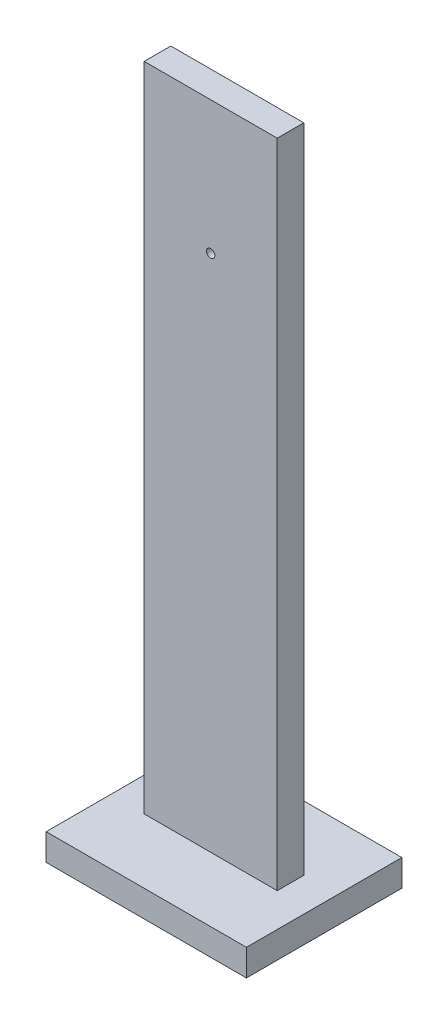
ISO-10303-21;
HEADER;
FILE_DESCRIPTION(('STEP AP214'),'2;1');
FILE_NAME('part.step','',(''),(''),'','','');
FILE_SCHEMA(('AUTOMOTIVE_DESIGN { 1 0 10303 214 1 1 1 1 }'));
ENDSEC;
DATA;
#1=APPLICATION_CONTEXT('core data for automotive mechanical design processes');
#2=APPLICATION_PROTOCOL_DEFINITION('international standard','automotive_design',2000,#1);
#3=PRODUCT_CONTEXT('',#1,'mechanical');
#4=PRODUCT('Part','Part','',(#3));
#5=PRODUCT_RELATED_PRODUCT_CATEGORY('part','',(#4));
#6=PRODUCT_DEFINITION_FORMATION('','',#4);
#7=PRODUCT_DEFINITION_CONTEXT('part definition',#1,'design');
#8=PRODUCT_DEFINITION('design','',#6,#7);
#9=PRODUCT_DEFINITION_SHAPE('','',#8);
#10=(LENGTH_UNIT() NAMED_UNIT(*) SI_UNIT(.MILLI.,.METRE.));
#11=(NAMED_UNIT(*) PLANE_ANGLE_UNIT() SI_UNIT($,.RADIAN.));
#12=(NAMED_UNIT(*) SI_UNIT($,.STERADIAN.) SOLID_ANGLE_UNIT());
#13=UNCERTAINTY_MEASURE_WITH_UNIT(LENGTH_MEASURE(1.E-05),#10,'distance_accuracy_value','');
#14=(GEOMETRIC_REPRESENTATION_CONTEXT(3) GLOBAL_UNCERTAINTY_ASSIGNED_CONTEXT((#13)) GLOBAL_UNIT_ASSIGNED_CONTEXT((#10,
#11,#12)) REPRESENTATION_CONTEXT('',''));
#15=CARTESIAN_POINT('',(0.,0.,0.));
#16=DIRECTION('',(0.,0.,1.));
#17=DIRECTION('',(1.,0.,0.));
#18=AXIS2_PLACEMENT_3D('',#15,#16,#17);
#19=CARTESIAN_POINT('',(0.,0.,10.));
#20=DIRECTION('',(0.,0.,-1.));
#21=DIRECTION('',(-1.,0.,0.));
#22=AXIS2_PLACEMENT_3D('',#19,#20,#21);
#23=PLANE('',#22);
#24=DIRECTION('',(0.,-1.,0.));
#25=VECTOR('',#24,1.);
#26=CARTESIAN_POINT('',(-50.,-250.,10.));
#27=LINE('',#26,#25);
#28=CARTESIAN_POINT('',(-50.,250.,10.));
#29=VERTEX_POINT('',#28);
#30=CARTESIAN_POINT('',(-50.,-240.,10.));
#31=VERTEX_POINT('',#30);
#32=EDGE_CURVE('E99',#29,#31,#27,.T.);
#33=ORIENTED_EDGE('',*,*,#32,.T.);
#34=DIRECTION('',(1.,0.,0.));
#35=VECTOR('',#34,1.);
#36=CARTESIAN_POINT('',(0.,-240.,10.));
#37=LINE('',#36,#35);
#38=CARTESIAN_POINT('',(50.,-240.,10.));
#39=VERTEX_POINT('',#38);
#40=EDGE_CURVE('E61',#31,#39,#37,.T.);
#41=ORIENTED_EDGE('',*,*,#40,.T.);
#42=DIRECTION('',(0.,1.,0.));
#43=VECTOR('',#42,1.);
#44=CARTESIAN_POINT('',(50.,-250.,10.));
#45=LINE('',#44,#43);
#46=CARTESIAN_POINT('',(50.,250.,10.));
#47=VERTEX_POINT('',#46);
#48=EDGE_CURVE('E108',#39,#47,#45,.T.);
#49=ORIENTED_EDGE('',*,*,#48,.T.);
#50=DIRECTION('',(-1.,0.,0.));
#51=VECTOR('',#50,1.);
#52=CARTESIAN_POINT('',(-50.,250.,10.));
#53=LINE('',#52,#51);
#54=EDGE_CURVE('E69',#47,#29,#53,.T.);
#55=ORIENTED_EDGE('',*,*,#54,.T.);
#56=EDGE_LOOP('',(#33,#41,#49,#55));
#57=FACE_BOUND('',#56,.T.);
#58=CARTESIAN_POINT('',(0.,150.,10.));
#59=DIRECTION('',(0.,0.,1.));
#60=DIRECTION('',(1.,0.,0.));
#61=AXIS2_PLACEMENT_3D('',#58,#59,#60);
#62=CIRCLE('',#61,3.125);
#63=CARTESIAN_POINT('',(3.125,150.,10.));
#64=VERTEX_POINT('',#63);
#65=EDGE_CURVE('E120',#64,#64,#62,.T.);
#66=ORIENTED_EDGE('',*,*,#65,.F.);
#67=EDGE_LOOP('',(#66));
#68=FACE_BOUND('',#67,.T.);
#69=ADVANCED_FACE('F45',(#57,#68),#23,.F.);
#70=CARTESIAN_POINT('',(0.,0.,-10.));
#71=DIRECTION('',(0.,0.,-1.));
#72=DIRECTION('',(-1.,0.,0.));
#73=AXIS2_PLACEMENT_3D('',#70,#71,#72);
#74=PLANE('',#73);
#75=DIRECTION('',(1.,0.,0.));
#76=VECTOR('',#75,1.);
#77=CARTESIAN_POINT('',(0.,-240.,-10.));
#78=LINE('',#77,#76);
#79=CARTESIAN_POINT('',(-50.,-240.,-10.));
#80=VERTEX_POINT('',#79);
#81=CARTESIAN_POINT('',(50.,-240.,-10.));
#82=VERTEX_POINT('',#81);
#83=EDGE_CURVE('E106',#80,#82,#78,.T.);
#84=ORIENTED_EDGE('',*,*,#83,.F.);
#85=DIRECTION('',(0.,-1.,0.));
#86=VECTOR('',#85,1.);
#87=CARTESIAN_POINT('',(-50.,-250.,-10.));
#88=LINE('',#87,#86);
#89=CARTESIAN_POINT('',(-50.,250.,-10.));
#90=VERTEX_POINT('',#89);
#91=EDGE_CURVE('E92',#90,#80,#88,.T.);
#92=ORIENTED_EDGE('',*,*,#91,.F.);
#93=DIRECTION('',(-1.,0.,0.));
#94=VECTOR('',#93,1.);
#95=CARTESIAN_POINT('',(-50.,250.,-10.));
#96=LINE('',#95,#94);
#97=CARTESIAN_POINT('',(50.,250.,-10.));
#98=VERTEX_POINT('',#97);
#99=EDGE_CURVE('E82',#98,#90,#96,.T.);
#100=ORIENTED_EDGE('',*,*,#99,.F.);
#101=DIRECTION('',(0.,1.,0.));
#102=VECTOR('',#101,1.);
#103=CARTESIAN_POINT('',(50.,-250.,-10.));
#104=LINE('',#103,#102);
#105=EDGE_CURVE('E93',#82,#98,#104,.T.);
#106=ORIENTED_EDGE('',*,*,#105,.F.);
#107=EDGE_LOOP('',(#84,#92,#100,#106));
#108=FACE_BOUND('',#107,.T.);
#109=CARTESIAN_POINT('',(0.,150.,-10.));
#110=DIRECTION('',(0.,0.,1.));
#111=DIRECTION('',(1.,0.,0.));
#112=AXIS2_PLACEMENT_3D('',#109,#110,#111);
#113=CIRCLE('',#112,3.125);
#114=CARTESIAN_POINT('',(3.125,150.,-10.));
#115=VERTEX_POINT('',#114);
#116=EDGE_CURVE('E125',#115,#115,#113,.T.);
#117=ORIENTED_EDGE('',*,*,#116,.T.);
#118=EDGE_LOOP('',(#117));
#119=FACE_BOUND('',#118,.T.);
#120=ADVANCED_FACE('F103',(#108,#119),#74,.T.);
#121=CARTESIAN_POINT('',(50.,-250.,10.));
#122=DIRECTION('',(-1.,0.,0.));
#123=DIRECTION('',(0.,0.,1.));
#124=AXIS2_PLACEMENT_3D('',#121,#122,#123);
#125=PLANE('',#124);
#126=ORIENTED_EDGE('',*,*,#48,.F.);
#127=DIRECTION('',(0.,0.,-1.));
#128=VECTOR('',#127,1.);
#129=CARTESIAN_POINT('',(50.,-240.,10.));
#130=LINE('',#129,#128);
#131=EDGE_CURVE('E131',#39,#82,#130,.T.);
#132=ORIENTED_EDGE('',*,*,#131,.T.);
#133=ORIENTED_EDGE('',*,*,#105,.T.);
#134=DIRECTION('',(0.,0.,-1.));
#135=VECTOR('',#134,1.);
#136=CARTESIAN_POINT('',(50.,250.,10.));
#137=LINE('',#136,#135);
#138=EDGE_CURVE('E54',#47,#98,#137,.T.);
#139=ORIENTED_EDGE('',*,*,#138,.F.);
#140=EDGE_LOOP('',(#126,#132,#133,#139));
#141=FACE_BOUND('',#140,.T.);
#142=ADVANCED_FACE('F47',(#141),#125,.F.);
#143=CARTESIAN_POINT('',(-50.,250.,10.));
#144=DIRECTION('',(0.,-1.,0.));
#145=DIRECTION('',(0.,0.,-1.));
#146=AXIS2_PLACEMENT_3D('',#143,#144,#145);
#147=PLANE('',#146);
#148=ORIENTED_EDGE('',*,*,#99,.T.);
#149=DIRECTION('',(0.,0.,-1.));
#150=VECTOR('',#149,1.);
#151=CARTESIAN_POINT('',(-50.,250.,10.));
#152=LINE('',#151,#150);
#153=EDGE_CURVE('E85',#29,#90,#152,.T.);
#154=ORIENTED_EDGE('',*,*,#153,.F.);
#155=ORIENTED_EDGE('',*,*,#54,.F.);
#156=ORIENTED_EDGE('',*,*,#138,.T.);
#157=EDGE_LOOP('',(#148,#154,#155,#156));
#158=FACE_BOUND('',#157,.T.);
#159=ADVANCED_FACE('F84',(#158),#147,.F.);
#160=CARTESIAN_POINT('',(-50.,-250.,10.));
#161=DIRECTION('',(1.,0.,0.));
#162=DIRECTION('',(0.,0.,-1.));
#163=AXIS2_PLACEMENT_3D('',#160,#161,#162);
#164=PLANE('',#163);
#165=ORIENTED_EDGE('',*,*,#91,.T.);
#166=DIRECTION('',(0.,0.,1.));
#167=VECTOR('',#166,1.);
#168=CARTESIAN_POINT('',(-50.,-240.,10.));
#169=LINE('',#168,#167);
#170=EDGE_CURVE('E11',#80,#31,#169,.T.);
#171=ORIENTED_EDGE('',*,*,#170,.T.);
#172=ORIENTED_EDGE('',*,*,#32,.F.);
#173=ORIENTED_EDGE('',*,*,#153,.T.);
#174=EDGE_LOOP('',(#165,#171,#172,#173));
#175=FACE_BOUND('',#174,.T.);
#176=ADVANCED_FACE('F97',(#175),#164,.F.);
#177=CARTESIAN_POINT('',(0.,150.,10.));
#178=DIRECTION('',(0.,0.,-1.));
#179=DIRECTION('',(-1.,0.,0.));
#180=AXIS2_PLACEMENT_3D('',#177,#178,#179);
#181=CYLINDRICAL_SURFACE('',#180,3.125);
#182=ORIENTED_EDGE('',*,*,#65,.T.);
#183=EDGE_LOOP('',(#182));
#184=FACE_BOUND('',#183,.T.);
#185=ORIENTED_EDGE('',*,*,#116,.F.);
#186=EDGE_LOOP('',(#185));
#187=FACE_BOUND('',#186,.T.);
#188=ADVANCED_FACE('F235',(#184,#187),#181,.F.);
#189=CARTESIAN_POINT('',(0.,-240.,0.));
#190=DIRECTION('',(0.,1.,0.));
#191=DIRECTION('',(0.,0.,1.));
#192=AXIS2_PLACEMENT_3D('',#189,#190,#191);
#193=PLANE('',#192);
#194=DIRECTION('',(0.,0.,1.));
#195=VECTOR('',#194,1.);
#196=CARTESIAN_POINT('',(75.2797962203028,-240.,-58.4347800907616));
#197=LINE('',#196,#195);
#198=CARTESIAN_POINT('',(75.2797962203028,-240.,-58.4347800907616));
#199=VERTEX_POINT('',#198);
#200=CARTESIAN_POINT('',(75.2797962203028,-240.,58.4347800907616));
#201=VERTEX_POINT('',#200);
#202=EDGE_CURVE('E169',#199,#201,#197,.T.);
#203=ORIENTED_EDGE('',*,*,#202,.F.);
#204=DIRECTION('',(1.,0.,0.));
#205=VECTOR('',#204,1.);
#206=CARTESIAN_POINT('',(-75.2797962203028,-240.,-58.4347800907616));
#207=LINE('',#206,#205);
#208=CARTESIAN_POINT('',(-75.2797962203028,-240.,-58.4347800907616));
#209=VERTEX_POINT('',#208);
#210=EDGE_CURVE('E156',#209,#199,#207,.T.);
#211=ORIENTED_EDGE('',*,*,#210,.F.);
#212=DIRECTION('',(0.,0.,-1.));
#213=VECTOR('',#212,1.);
#214=CARTESIAN_POINT('',(-75.2797962203028,-240.,-58.4347800907616));
#215=LINE('',#214,#213);
#216=CARTESIAN_POINT('',(-75.2797962203028,-240.,58.4347800907616));
#217=VERTEX_POINT('',#216);
#218=EDGE_CURVE('E161',#217,#209,#215,.T.);
#219=ORIENTED_EDGE('',*,*,#218,.F.);
#220=DIRECTION('',(-1.,0.,0.));
#221=VECTOR('',#220,1.);
#222=CARTESIAN_POINT('',(-75.2797962203028,-240.,58.4347800907616));
#223=LINE('',#222,#221);
#224=EDGE_CURVE('E165',#201,#217,#223,.T.);
#225=ORIENTED_EDGE('',*,*,#224,.F.);
#226=EDGE_LOOP('',(#203,#211,#219,#225));
#227=FACE_BOUND('',#226,.T.);
#228=ORIENTED_EDGE('',*,*,#131,.F.);
#229=ORIENTED_EDGE('',*,*,#40,.F.);
#230=ORIENTED_EDGE('',*,*,#170,.F.);
#231=ORIENTED_EDGE('',*,*,#83,.T.);
#232=EDGE_LOOP('',(#228,#229,#230,#231));
#233=FACE_BOUND('',#232,.T.);
#234=ADVANCED_FACE('F219',(#227,#233),#193,.T.);
#235=CARTESIAN_POINT('',(75.2797962203028,-260.,-58.4347800907616));
#236=DIRECTION('',(-1.,0.,0.));
#237=DIRECTION('',(0.,0.,1.));
#238=AXIS2_PLACEMENT_3D('',#235,#236,#237);
#239=PLANE('',#238);
#240=ORIENTED_EDGE('',*,*,#202,.T.);
#241=DIRECTION('',(0.,1.,0.));
#242=VECTOR('',#241,1.);
#243=CARTESIAN_POINT('',(75.2797962203028,-260.,58.4347800907616));
#244=LINE('',#243,#242);
#245=CARTESIAN_POINT('',(75.2797962203028,-260.,58.4347800907616));
#246=VERTEX_POINT('',#245);
#247=EDGE_CURVE('E139',#246,#201,#244,.T.);
#248=ORIENTED_EDGE('',*,*,#247,.F.);
#249=DIRECTION('',(0.,0.,1.));
#250=VECTOR('',#249,1.);
#251=CARTESIAN_POINT('',(75.2797962203028,-260.,-58.4347800907616));
#252=LINE('',#251,#250);
#253=CARTESIAN_POINT('',(75.2797962203028,-260.,-58.4347800907616));
#254=VERTEX_POINT('',#253);
#255=EDGE_CURVE('E160',#254,#246,#252,.T.);
#256=ORIENTED_EDGE('',*,*,#255,.F.);
#257=DIRECTION('',(0.,1.,0.));
#258=VECTOR('',#257,1.);
#259=CARTESIAN_POINT('',(75.2797962203028,-260.,-58.4347800907616));
#260=LINE('',#259,#258);
#261=EDGE_CURVE('E151',#254,#199,#260,.T.);
#262=ORIENTED_EDGE('',*,*,#261,.T.);
#263=EDGE_LOOP('',(#240,#248,#256,#262));
#264=FACE_BOUND('',#263,.T.);
#265=ADVANCED_FACE('F200',(#264),#239,.F.);
#266=CARTESIAN_POINT('',(-75.2797962203028,-260.,58.4347800907616));
#267=DIRECTION('',(0.,0.,-1.));
#268=DIRECTION('',(-1.,0.,0.));
#269=AXIS2_PLACEMENT_3D('',#266,#267,#268);
#270=PLANE('',#269);
#271=ORIENTED_EDGE('',*,*,#224,.T.);
#272=DIRECTION('',(0.,1.,0.));
#273=VECTOR('',#272,1.);
#274=CARTESIAN_POINT('',(-75.2797962203028,-260.,58.4347800907616));
#275=LINE('',#274,#273);
#276=CARTESIAN_POINT('',(-75.2797962203028,-260.,58.4347800907616));
#277=VERTEX_POINT('',#276);
#278=EDGE_CURVE('E143',#277,#217,#275,.T.);
#279=ORIENTED_EDGE('',*,*,#278,.F.);
#280=DIRECTION('',(-1.,0.,0.));
#281=VECTOR('',#280,1.);
#282=CARTESIAN_POINT('',(-75.2797962203028,-260.,58.4347800907616));
#283=LINE('',#282,#281);
#284=EDGE_CURVE('E180',#246,#277,#283,.T.);
#285=ORIENTED_EDGE('',*,*,#284,.F.);
#286=ORIENTED_EDGE('',*,*,#247,.T.);
#287=EDGE_LOOP('',(#271,#279,#285,#286));
#288=FACE_BOUND('',#287,.T.);
#289=ADVANCED_FACE('F204',(#288),#270,.F.);
#290=CARTESIAN_POINT('',(-75.2797962203028,-260.,-58.4347800907616));
#291=DIRECTION('',(1.,0.,0.));
#292=DIRECTION('',(0.,0.,-1.));
#293=AXIS2_PLACEMENT_3D('',#290,#291,#292);
#294=PLANE('',#293);
#295=ORIENTED_EDGE('',*,*,#218,.T.);
#296=DIRECTION('',(0.,1.,0.));
#297=VECTOR('',#296,1.);
#298=CARTESIAN_POINT('',(-75.2797962203028,-260.,-58.4347800907616));
#299=LINE('',#298,#297);
#300=CARTESIAN_POINT('',(-75.2797962203028,-260.,-58.4347800907616));
#301=VERTEX_POINT('',#300);
#302=EDGE_CURVE('E147',#301,#209,#299,.T.);
#303=ORIENTED_EDGE('',*,*,#302,.F.);
#304=DIRECTION('',(0.,0.,-1.));
#305=VECTOR('',#304,1.);
#306=CARTESIAN_POINT('',(-75.2797962203028,-260.,-58.4347800907616));
#307=LINE('',#306,#305);
#308=EDGE_CURVE('E176',#277,#301,#307,.T.);
#309=ORIENTED_EDGE('',*,*,#308,.F.);
#310=ORIENTED_EDGE('',*,*,#278,.T.);
#311=EDGE_LOOP('',(#295,#303,#309,#310));
#312=FACE_BOUND('',#311,.T.);
#313=ADVANCED_FACE('F254',(#312),#294,.F.);
#314=CARTESIAN_POINT('',(-75.2797962203028,-260.,-58.4347800907616));
#315=DIRECTION('',(0.,0.,1.));
#316=DIRECTION('',(1.,0.,0.));
#317=AXIS2_PLACEMENT_3D('',#314,#315,#316);
#318=PLANE('',#317);
#319=ORIENTED_EDGE('',*,*,#210,.T.);
#320=ORIENTED_EDGE('',*,*,#261,.F.);
#321=DIRECTION('',(1.,0.,0.));
#322=VECTOR('',#321,1.);
#323=CARTESIAN_POINT('',(-75.2797962203028,-260.,-58.4347800907616));
#324=LINE('',#323,#322);
#325=EDGE_CURVE('E155',#301,#254,#324,.T.);
#326=ORIENTED_EDGE('',*,*,#325,.F.);
#327=ORIENTED_EDGE('',*,*,#302,.T.);
#328=EDGE_LOOP('',(#319,#320,#326,#327));
#329=FACE_BOUND('',#328,.T.);
#330=ADVANCED_FACE('F251',(#329),#318,.F.);
#331=CARTESIAN_POINT('',(0.,-260.,0.));
#332=DIRECTION('',(0.,1.,0.));
#333=DIRECTION('',(0.,0.,1.));
#334=AXIS2_PLACEMENT_3D('',#331,#332,#333);
#335=PLANE('',#334);
#336=ORIENTED_EDGE('',*,*,#255,.T.);
#337=ORIENTED_EDGE('',*,*,#284,.T.);
#338=ORIENTED_EDGE('',*,*,#308,.T.);
#339=ORIENTED_EDGE('',*,*,#325,.T.);
#340=EDGE_LOOP('',(#336,#337,#338,#339));
#341=FACE_BOUND('',#340,.T.);
#342=ADVANCED_FACE('F190',(#341),#335,.F.);
#343=CLOSED_SHELL('',(#69,#120,#142,#159,#176,#188,#234,#265,#289,#313,#330,#342));
#344=MANIFOLD_SOLID_BREP('B2',#343);
#345=ADVANCED_BREP_SHAPE_REPRESENTATION('',(#18,#344),#14);
#346=SHAPE_DEFINITION_REPRESENTATION(#9,#345);
ENDSEC;
END-ISO-10303-21;
